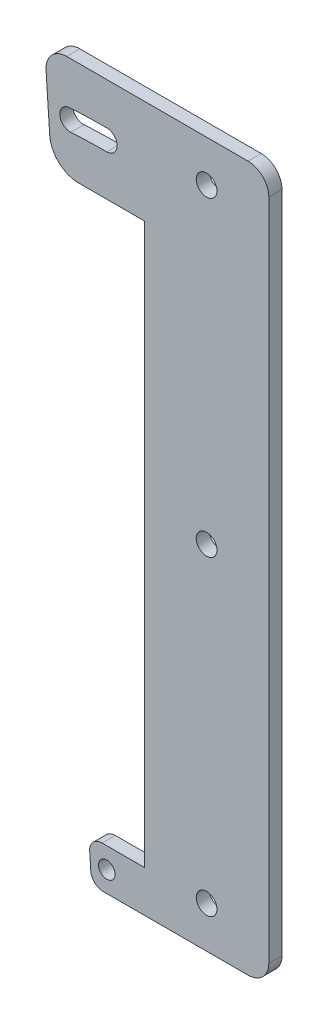
ISO-10303-21;
HEADER;
FILE_DESCRIPTION(('STEP AP214'),'2;1');
FILE_NAME('part.step','',(''),(''),'','','');
FILE_SCHEMA(('AUTOMOTIVE_DESIGN { 1 0 10303 214 1 1 1 1 }'));
ENDSEC;
DATA;
#1=APPLICATION_CONTEXT('core data for automotive mechanical design processes');
#2=APPLICATION_PROTOCOL_DEFINITION('international standard','automotive_design',2000,#1);
#3=PRODUCT_CONTEXT('',#1,'mechanical');
#4=PRODUCT('Part','Part','',(#3));
#5=PRODUCT_RELATED_PRODUCT_CATEGORY('part','',(#4));
#6=PRODUCT_DEFINITION_FORMATION('','',#4);
#7=PRODUCT_DEFINITION_CONTEXT('part definition',#1,'design');
#8=PRODUCT_DEFINITION('design','',#6,#7);
#9=PRODUCT_DEFINITION_SHAPE('','',#8);
#10=(LENGTH_UNIT() NAMED_UNIT(*) SI_UNIT(.MILLI.,.METRE.));
#11=(NAMED_UNIT(*) PLANE_ANGLE_UNIT() SI_UNIT($,.RADIAN.));
#12=(NAMED_UNIT(*) SI_UNIT($,.STERADIAN.) SOLID_ANGLE_UNIT());
#13=UNCERTAINTY_MEASURE_WITH_UNIT(LENGTH_MEASURE(1.E-05),#10,'distance_accuracy_value','');
#14=(GEOMETRIC_REPRESENTATION_CONTEXT(3) GLOBAL_UNCERTAINTY_ASSIGNED_CONTEXT((#13)) GLOBAL_UNIT_ASSIGNED_CONTEXT((#10,
#11,#12)) REPRESENTATION_CONTEXT('',''));
#15=CARTESIAN_POINT('',(0.,0.,0.));
#16=DIRECTION('',(0.,0.,1.));
#17=DIRECTION('',(1.,0.,0.));
#18=AXIS2_PLACEMENT_3D('',#15,#16,#17);
#19=CARTESIAN_POINT('',(0.,0.,-3.175));
#20=DIRECTION('',(-1.,0.,0.));
#21=DIRECTION('',(0.,0.,1.));
#22=AXIS2_PLACEMENT_3D('',#19,#20,#21);
#23=PLANE('',#22);
#24=DIRECTION('',(0.,-1.,0.));
#25=VECTOR('',#24,1.);
#26=CARTESIAN_POINT('',(0.,0.,-3.175));
#27=LINE('',#26,#25);
#28=CARTESIAN_POINT('',(0.,145.,-3.175));
#29=VERTEX_POINT('',#28);
#30=CARTESIAN_POINT('',(0.,10.,-3.175));
#31=VERTEX_POINT('',#30);
#32=EDGE_CURVE('E366',#29,#31,#27,.T.);
#33=ORIENTED_EDGE('',*,*,#32,.T.);
#34=DIRECTION('',(0.,0.,1.));
#35=VECTOR('',#34,1.);
#36=CARTESIAN_POINT('',(0.,10.,-3.17499999999999));
#37=LINE('',#36,#35);
#38=CARTESIAN_POINT('',(0.,10.,0.));
#39=VERTEX_POINT('',#38);
#40=EDGE_CURVE('E95',#31,#39,#37,.T.);
#41=ORIENTED_EDGE('',*,*,#40,.T.);
#42=DIRECTION('',(0.,-1.,0.));
#43=VECTOR('',#42,1.);
#44=CARTESIAN_POINT('',(0.,0.,0.));
#45=LINE('',#44,#43);
#46=CARTESIAN_POINT('',(0.,145.,0.));
#47=VERTEX_POINT('',#46);
#48=EDGE_CURVE('E90',#47,#39,#45,.T.);
#49=ORIENTED_EDGE('',*,*,#48,.F.);
#50=DIRECTION('',(0.,0.,1.));
#51=VECTOR('',#50,1.);
#52=CARTESIAN_POINT('',(0.,145.,-3.1749999999999));
#53=LINE('',#52,#51);
#54=EDGE_CURVE('E14',#29,#47,#53,.T.);
#55=ORIENTED_EDGE('',*,*,#54,.F.);
#56=EDGE_LOOP('',(#33,#41,#49,#55));
#57=FACE_BOUND('',#56,.T.);
#58=ADVANCED_FACE('F86',(#57),#23,.T.);
#59=CARTESIAN_POINT('',(0.,170.,-3.175));
#60=DIRECTION('',(0.,1.,0.));
#61=DIRECTION('',(0.,0.,1.));
#62=AXIS2_PLACEMENT_3D('',#59,#60,#61);
#63=PLANE('',#62);
#64=DIRECTION('',(-1.,0.,0.));
#65=VECTOR('',#64,1.);
#66=CARTESIAN_POINT('',(0.,170.,0.));
#67=LINE('',#66,#65);
#68=CARTESIAN_POINT('',(25.,170.,0.));
#69=VERTEX_POINT('',#68);
#70=CARTESIAN_POINT('',(-18.7202898598315,170.,1.02348685082632E-13));
#71=VERTEX_POINT('',#70);
#72=EDGE_CURVE('E372',#69,#71,#67,.T.);
#73=ORIENTED_EDGE('',*,*,#72,.F.);
#74=DIRECTION('',(0.,0.,1.));
#75=VECTOR('',#74,1.);
#76=CARTESIAN_POINT('',(25.,170.,-3.175));
#77=LINE('',#76,#75);
#78=CARTESIAN_POINT('',(25.,170.,-3.175));
#79=VERTEX_POINT('',#78);
#80=EDGE_CURVE('E111',#69,#79,#77,.F.);
#81=ORIENTED_EDGE('',*,*,#80,.T.);
#82=DIRECTION('',(-1.,0.,0.));
#83=VECTOR('',#82,1.);
#84=CARTESIAN_POINT('',(0.,170.,-3.175));
#85=LINE('',#84,#83);
#86=CARTESIAN_POINT('',(-18.7202898598315,170.,-3.1749999999999));
#87=VERTEX_POINT('',#86);
#88=EDGE_CURVE('E404',#79,#87,#85,.T.);
#89=ORIENTED_EDGE('',*,*,#88,.T.);
#90=DIRECTION('',(0.,0.,1.));
#91=VECTOR('',#90,1.);
#92=CARTESIAN_POINT('',(-18.7202898598315,170.,1.01481323344643E-13));
#93=LINE('',#92,#91);
#94=EDGE_CURVE('E223',#87,#71,#93,.T.);
#95=ORIENTED_EDGE('',*,*,#94,.T.);
#96=EDGE_LOOP('',(#73,#81,#89,#95));
#97=FACE_BOUND('',#96,.T.);
#98=ADVANCED_FACE('F451',(#97),#63,.T.);
#99=CARTESIAN_POINT('',(30.,0.,-3.175));
#100=DIRECTION('',(1.,0.,0.));
#101=DIRECTION('',(0.,0.,-1.));
#102=AXIS2_PLACEMENT_3D('',#99,#100,#101);
#103=PLANE('',#102);
#104=DIRECTION('',(0.,1.,0.));
#105=VECTOR('',#104,1.);
#106=CARTESIAN_POINT('',(30.,0.,0.));
#107=LINE('',#106,#105);
#108=CARTESIAN_POINT('',(30.,5.,0.));
#109=VERTEX_POINT('',#108);
#110=CARTESIAN_POINT('',(30.,165.,0.));
#111=VERTEX_POINT('',#110);
#112=EDGE_CURVE('E375',#109,#111,#107,.T.);
#113=ORIENTED_EDGE('',*,*,#112,.F.);
#114=DIRECTION('',(0.,0.,1.));
#115=VECTOR('',#114,1.);
#116=CARTESIAN_POINT('',(30.,5.,-3.175));
#117=LINE('',#116,#115);
#118=CARTESIAN_POINT('',(30.,5.,-3.175));
#119=VERTEX_POINT('',#118);
#120=EDGE_CURVE('E421',#109,#119,#117,.F.);
#121=ORIENTED_EDGE('',*,*,#120,.T.);
#122=DIRECTION('',(0.,1.,0.));
#123=VECTOR('',#122,1.);
#124=CARTESIAN_POINT('',(30.,0.,-3.175));
#125=LINE('',#124,#123);
#126=CARTESIAN_POINT('',(30.,165.,-3.175));
#127=VERTEX_POINT('',#126);
#128=EDGE_CURVE('E399',#119,#127,#125,.T.);
#129=ORIENTED_EDGE('',*,*,#128,.T.);
#130=DIRECTION('',(0.,0.,1.));
#131=VECTOR('',#130,1.);
#132=CARTESIAN_POINT('',(30.,165.,-3.175));
#133=LINE('',#132,#131);
#134=EDGE_CURVE('E418',#127,#111,#133,.T.);
#135=ORIENTED_EDGE('',*,*,#134,.T.);
#136=EDGE_LOOP('',(#113,#121,#129,#135));
#137=FACE_BOUND('',#136,.T.);
#138=ADVANCED_FACE('F444',(#137),#103,.T.);
#139=CARTESIAN_POINT('',(0.,0.,-3.175));
#140=DIRECTION('',(0.,-1.,0.));
#141=DIRECTION('',(0.,0.,-1.));
#142=AXIS2_PLACEMENT_3D('',#139,#140,#141);
#143=PLANE('',#142);
#144=DIRECTION('',(1.,0.,0.));
#145=VECTOR('',#144,1.);
#146=CARTESIAN_POINT('',(0.,0.,-3.175));
#147=LINE('',#146,#145);
#148=CARTESIAN_POINT('',(-9.93342579991076,0.,-3.17499999999996));
#149=VERTEX_POINT('',#148);
#150=CARTESIAN_POINT('',(25.,0.,-3.175));
#151=VERTEX_POINT('',#150);
#152=EDGE_CURVE('E371',#149,#151,#147,.T.);
#153=ORIENTED_EDGE('',*,*,#152,.T.);
#154=DIRECTION('',(0.,0.,1.));
#155=VECTOR('',#154,1.);
#156=CARTESIAN_POINT('',(25.,0.,-3.175));
#157=LINE('',#156,#155);
#158=CARTESIAN_POINT('',(25.,0.,0.));
#159=VERTEX_POINT('',#158);
#160=EDGE_CURVE('E407',#151,#159,#157,.T.);
#161=ORIENTED_EDGE('',*,*,#160,.T.);
#162=DIRECTION('',(1.,0.,0.));
#163=VECTOR('',#162,1.);
#164=CARTESIAN_POINT('',(0.,0.,0.));
#165=LINE('',#164,#163);
#166=CARTESIAN_POINT('',(-9.93342579991074,0.,0.));
#167=VERTEX_POINT('',#166);
#168=EDGE_CURVE('E373',#167,#159,#165,.T.);
#169=ORIENTED_EDGE('',*,*,#168,.F.);
#170=DIRECTION('',(0.,0.,1.));
#171=VECTOR('',#170,1.);
#172=CARTESIAN_POINT('',(-9.93342579991074,0.,0.));
#173=LINE('',#172,#171);
#174=EDGE_CURVE('E276',#167,#149,#173,.F.);
#175=ORIENTED_EDGE('',*,*,#174,.T.);
#176=EDGE_LOOP('',(#153,#161,#169,#175));
#177=FACE_BOUND('',#176,.T.);
#178=ADVANCED_FACE('F438',(#177),#143,.T.);
#179=CARTESIAN_POINT('',(0.,0.,-3.175));
#180=DIRECTION('',(0.,0.,-1.));
#181=DIRECTION('',(-1.,0.,0.));
#182=AXIS2_PLACEMENT_3D('',#179,#180,#181);
#183=PLANE('',#182);
#184=CARTESIAN_POINT('',(15.,10.,-3.175));
#185=DIRECTION('',(0.,0.,-1.));
#186=DIRECTION('',(-1.,0.,0.));
#187=AXIS2_PLACEMENT_3D('',#184,#185,#186);
#188=CIRCLE('',#187,2.5);
#189=CARTESIAN_POINT('',(12.5,10.,-3.175));
#190=VERTEX_POINT('',#189);
#191=EDGE_CURVE('E387',#190,#190,#188,.T.);
#192=ORIENTED_EDGE('',*,*,#191,.F.);
#193=EDGE_LOOP('',(#192));
#194=FACE_BOUND('',#193,.T.);
#195=CARTESIAN_POINT('',(15.,160.,-3.175));
#196=DIRECTION('',(0.,0.,-1.));
#197=DIRECTION('',(-1.,0.,0.));
#198=AXIS2_PLACEMENT_3D('',#195,#196,#197);
#199=CIRCLE('',#198,2.5);
#200=CARTESIAN_POINT('',(12.5,160.,-3.175));
#201=VERTEX_POINT('',#200);
#202=EDGE_CURVE('E793',#201,#201,#199,.T.);
#203=ORIENTED_EDGE('',*,*,#202,.F.);
#204=EDGE_LOOP('',(#203));
#205=FACE_BOUND('',#204,.T.);
#206=CARTESIAN_POINT('',(15.,85.,-3.175));
#207=DIRECTION('',(0.,0.,-1.));
#208=DIRECTION('',(-1.,0.,0.));
#209=AXIS2_PLACEMENT_3D('',#206,#207,#208);
#210=CIRCLE('',#209,2.5);
#211=CARTESIAN_POINT('',(12.5,85.,-3.175));
#212=VERTEX_POINT('',#211);
#213=EDGE_CURVE('E378',#212,#212,#210,.T.);
#214=ORIENTED_EDGE('',*,*,#213,.F.);
#215=EDGE_LOOP('',(#214));
#216=FACE_BOUND('',#215,.T.);
#217=ORIENTED_EDGE('',*,*,#128,.F.);
#218=CARTESIAN_POINT('',(25.,5.,-3.175));
#219=DIRECTION('',(0.,0.,-1.));
#220=DIRECTION('',(-1.,0.,0.));
#221=AXIS2_PLACEMENT_3D('',#218,#219,#220);
#222=CIRCLE('',#221,5.);
#223=EDGE_CURVE('E425',#119,#151,#222,.T.);
#224=ORIENTED_EDGE('',*,*,#223,.T.);
#225=ORIENTED_EDGE('',*,*,#152,.F.);
#226=CARTESIAN_POINT('',(-9.93342579991076,3.,-3.17499999999996));
#227=DIRECTION('',(0.,0.,-1.));
#228=DIRECTION('',(-1.,0.,0.));
#229=AXIS2_PLACEMENT_3D('',#226,#227,#228);
#230=CIRCLE('',#229,3.);
#231=CARTESIAN_POINT('',(-12.9267919431435,2.80060307788792,-3.17499999999994));
#232=VERTEX_POINT('',#231);
#233=EDGE_CURVE('E279',#149,#232,#230,.T.);
#234=ORIENTED_EDGE('',*,*,#233,.T.);
#235=DIRECTION('',(0.0664656407040243,-0.997788714410924,0.));
#236=VECTOR('',#235,1.);
#237=CARTESIAN_POINT('',(-12.6834647954809,-0.852247918143562,-3.17499999999994));
#238=LINE('',#237,#236);
#239=CARTESIAN_POINT('',(-13.193243706905,6.80060307788793,-3.17499999999993));
#240=VERTEX_POINT('',#239);
#241=EDGE_CURVE('E293',#240,#232,#238,.T.);
#242=ORIENTED_EDGE('',*,*,#241,.F.);
#243=CARTESIAN_POINT('',(-10.1998775636722,6.99999999999999,-3.17499999999995));
#244=DIRECTION('',(0.,0.,-1.));
#245=DIRECTION('',(-1.,0.,0.));
#246=AXIS2_PLACEMENT_3D('',#243,#244,#245);
#247=CIRCLE('',#246,3.);
#248=CARTESIAN_POINT('',(-10.1998775636723,9.99999999999999,-3.17499999999995));
#249=VERTEX_POINT('',#248);
#250=EDGE_CURVE('E283',#240,#249,#247,.T.);
#251=ORIENTED_EDGE('',*,*,#250,.T.);
#252=DIRECTION('',(-1.,0.,0.));
#253=VECTOR('',#252,1.);
#254=CARTESIAN_POINT('',(-2.0322177477909,10.,-3.175));
#255=LINE('',#254,#253);
#256=EDGE_CURVE('E311',#249,#31,#255,.F.);
#257=ORIENTED_EDGE('',*,*,#256,.T.);
#258=ORIENTED_EDGE('',*,*,#32,.F.);
#259=DIRECTION('',(-1.,0.,0.));
#260=VECTOR('',#259,1.);
#261=CARTESIAN_POINT('',(-2.0322177477909,145.,-3.175));
#262=LINE('',#261,#260);
#263=CARTESIAN_POINT('',(-15.8498892551873,145.,-3.17499999999992));
#264=VERTEX_POINT('',#263);
#265=EDGE_CURVE('E222',#29,#264,#262,.T.);
#266=ORIENTED_EDGE('',*,*,#265,.T.);
#267=CARTESIAN_POINT('',(-15.8498892551873,152.,-3.17499999999992));
#268=DIRECTION('',(0.,0.,-1.));
#269=DIRECTION('',(-1.,0.,0.));
#270=AXIS2_PLACEMENT_3D('',#267,#268,#269);
#271=CIRCLE('',#270,7.);
#272=CARTESIAN_POINT('',(-22.8344102560638,151.534740515072,-3.17499999999987));
#273=VERTEX_POINT('',#272);
#274=EDGE_CURVE('E238',#264,#273,#271,.T.);
#275=ORIENTED_EDGE('',*,*,#274,.T.);
#276=DIRECTION('',(0.0664656407040235,-0.997788714410924,0.));
#277=VECTOR('',#276,1.);
#278=CARTESIAN_POINT('',(-12.683464795481,-0.852247918143554,-3.17499999999994));
#279=LINE('',#278,#277);
#280=CARTESIAN_POINT('',(-23.7092334318862,164.66767179648,-3.17499999999986));
#281=VERTEX_POINT('',#280);
#282=EDGE_CURVE('E256',#281,#273,#279,.T.);
#283=ORIENTED_EDGE('',*,*,#282,.F.);
#284=CARTESIAN_POINT('',(-18.7202898598315,165.,-3.1749999999999));
#285=DIRECTION('',(0.,0.,-1.));
#286=DIRECTION('',(-1.,0.,0.));
#287=AXIS2_PLACEMENT_3D('',#284,#285,#286);
#288=CIRCLE('',#287,5.);
#289=EDGE_CURVE('E242',#281,#87,#288,.T.);
#290=ORIENTED_EDGE('',*,*,#289,.T.);
#291=ORIENTED_EDGE('',*,*,#88,.F.);
#292=CARTESIAN_POINT('',(25.,165.,-3.175));
#293=DIRECTION('',(0.,0.,-1.));
#294=DIRECTION('',(-1.,0.,0.));
#295=AXIS2_PLACEMENT_3D('',#292,#293,#294);
#296=CIRCLE('',#295,5.);
#297=EDGE_CURVE('E422',#79,#127,#296,.T.);
#298=ORIENTED_EDGE('',*,*,#297,.T.);
#299=EDGE_LOOP('',(#217,#224,#225,#234,#242,#251,#257,#258,#266,#275,#283,#290,#291,#298));
#300=FACE_BOUND('',#299,.T.);
#301=CARTESIAN_POINT('',(-9.0644354955818,4.99999999999999,-3.17499999999996));
#302=DIRECTION('',(0.,0.,-1.));
#303=DIRECTION('',(-1.,0.,0.));
#304=AXIS2_PLACEMENT_3D('',#301,#302,#303);
#305=CIRCLE('',#304,2.);
#306=CARTESIAN_POINT('',(-11.0644354955818,4.99999999999999,-3.17499999999995));
#307=VERTEX_POINT('',#306);
#308=EDGE_CURVE('E267',#307,#307,#305,.T.);
#309=ORIENTED_EDGE('',*,*,#308,.F.);
#310=EDGE_LOOP('',(#309));
#311=FACE_BOUND('',#310,.T.);
#312=CARTESIAN_POINT('',(-9.06443549558192,157.4,-3.17499999999996));
#313=DIRECTION('',(0.,0.,-1.));
#314=DIRECTION('',(-1.,0.,0.));
#315=AXIS2_PLACEMENT_3D('',#312,#313,#314);
#316=CIRCLE('',#315,2.5);
#317=CARTESIAN_POINT('',(-9.06443549558193,159.9,-3.17499999999942));
#318=VERTEX_POINT('',#317);
#319=CARTESIAN_POINT('',(-9.06443549558193,154.9,-3.17499999999944));
#320=VERTEX_POINT('',#319);
#321=EDGE_CURVE('E319',#318,#320,#316,.T.);
#322=ORIENTED_EDGE('',*,*,#321,.F.);
#323=CARTESIAN_POINT('',(-9.0644354955819,5.,-3.17499999999996));
#324=DIRECTION('',(0.,0.,-1.));
#325=DIRECTION('',(-1.,0.,0.));
#326=AXIS2_PLACEMENT_3D('',#323,#324,#325);
#327=CIRCLE('',#326,154.9);
#328=CARTESIAN_POINT('',(-18.0342025559494,159.640076561294,-3.1749999999999));
#329=VERTEX_POINT('',#328);
#330=EDGE_CURVE('E330',#329,#318,#327,.T.);
#331=ORIENTED_EDGE('',*,*,#330,.F.);
#332=CARTESIAN_POINT('',(-17.8894354955819,157.144271581286,-3.1749999999999));
#333=DIRECTION('',(0.,0.,-1.));
#334=DIRECTION('',(-1.,0.,0.));
#335=AXIS2_PLACEMENT_3D('',#332,#333,#334);
#336=CIRCLE('',#335,2.49999999999999);
#337=CARTESIAN_POINT('',(-17.7446684352145,154.648466601278,-3.1749999999999));
#338=VERTEX_POINT('',#337);
#339=EDGE_CURVE('E338',#338,#329,#336,.T.);
#340=ORIENTED_EDGE('',*,*,#339,.F.);
#341=CARTESIAN_POINT('',(-9.0644354955819,5.,-3.17499999999996));
#342=DIRECTION('',(0.,0.,-1.));
#343=DIRECTION('',(-1.,0.,0.));
#344=AXIS2_PLACEMENT_3D('',#341,#342,#343);
#345=CIRCLE('',#344,149.9);
#346=EDGE_CURVE('E347',#320,#338,#345,.F.);
#347=ORIENTED_EDGE('',*,*,#346,.F.);
#348=EDGE_LOOP('',(#322,#331,#340,#347));
#349=FACE_BOUND('',#348,.T.);
#350=ADVANCED_FACE('F361',(#194,#205,#216,#300,#311,#349),#183,.T.);
#351=CARTESIAN_POINT('',(0.,0.,0.));
#352=DIRECTION('',(0.,0.,-1.));
#353=DIRECTION('',(-1.,0.,0.));
#354=AXIS2_PLACEMENT_3D('',#351,#352,#353);
#355=PLANE('',#354);
#356=CARTESIAN_POINT('',(15.,10.,1.04083408558608E-13));
#357=DIRECTION('',(0.,0.,-1.));
#358=DIRECTION('',(-1.,0.,0.));
#359=AXIS2_PLACEMENT_3D('',#356,#357,#358);
#360=CIRCLE('',#359,2.5);
#361=CARTESIAN_POINT('',(12.5,10.,1.04083408558608E-13));
#362=VERTEX_POINT('',#361);
#363=EDGE_CURVE('E790',#362,#362,#360,.T.);
#364=ORIENTED_EDGE('',*,*,#363,.T.);
#365=EDGE_LOOP('',(#364));
#366=FACE_BOUND('',#365,.T.);
#367=CARTESIAN_POINT('',(15.,160.,1.04083408558608E-13));
#368=DIRECTION('',(0.,0.,-1.));
#369=DIRECTION('',(-1.,0.,0.));
#370=AXIS2_PLACEMENT_3D('',#367,#368,#369);
#371=CIRCLE('',#370,2.5);
#372=CARTESIAN_POINT('',(12.5,160.,1.04083408558608E-13));
#373=VERTEX_POINT('',#372);
#374=EDGE_CURVE('E384',#373,#373,#371,.T.);
#375=ORIENTED_EDGE('',*,*,#374,.T.);
#376=EDGE_LOOP('',(#375));
#377=FACE_BOUND('',#376,.T.);
#378=CARTESIAN_POINT('',(15.,85.,1.04083408558608E-13));
#379=DIRECTION('',(0.,0.,-1.));
#380=DIRECTION('',(-1.,0.,0.));
#381=AXIS2_PLACEMENT_3D('',#378,#379,#380);
#382=CIRCLE('',#381,2.5);
#383=CARTESIAN_POINT('',(12.5,85.,1.04083408558608E-13));
#384=VERTEX_POINT('',#383);
#385=EDGE_CURVE('E374',#384,#384,#382,.T.);
#386=ORIENTED_EDGE('',*,*,#385,.T.);
#387=EDGE_LOOP('',(#386));
#388=FACE_BOUND('',#387,.T.);
#389=ORIENTED_EDGE('',*,*,#168,.T.);
#390=CARTESIAN_POINT('',(25.,5.,0.));
#391=DIRECTION('',(0.,0.,-1.));
#392=DIRECTION('',(-1.,0.,0.));
#393=AXIS2_PLACEMENT_3D('',#390,#391,#392);
#394=CIRCLE('',#393,5.);
#395=EDGE_CURVE('E416',#159,#109,#394,.F.);
#396=ORIENTED_EDGE('',*,*,#395,.T.);
#397=ORIENTED_EDGE('',*,*,#112,.T.);
#398=CARTESIAN_POINT('',(25.,165.,0.));
#399=DIRECTION('',(0.,0.,-1.));
#400=DIRECTION('',(-1.,0.,0.));
#401=AXIS2_PLACEMENT_3D('',#398,#399,#400);
#402=CIRCLE('',#401,5.);
#403=EDGE_CURVE('E414',#111,#69,#402,.F.);
#404=ORIENTED_EDGE('',*,*,#403,.T.);
#405=ORIENTED_EDGE('',*,*,#72,.T.);
#406=CARTESIAN_POINT('',(-18.7202898598315,165.,1.02348685082632E-13));
#407=DIRECTION('',(0.,0.,-1.));
#408=DIRECTION('',(-1.,0.,0.));
#409=AXIS2_PLACEMENT_3D('',#406,#407,#408);
#410=CIRCLE('',#409,5.);
#411=CARTESIAN_POINT('',(-23.7092334318861,164.66767179648,1.37043154602168E-13));
#412=VERTEX_POINT('',#411);
#413=EDGE_CURVE('E234',#71,#412,#410,.F.);
#414=ORIENTED_EDGE('',*,*,#413,.T.);
#415=DIRECTION('',(-0.0664656407040234,0.997788714410924,0.));
#416=VECTOR('',#415,1.);
#417=CARTESIAN_POINT('',(-24.0644354955819,170.,1.38777878078145E-13));
#418=LINE('',#417,#416);
#419=CARTESIAN_POINT('',(-22.8344102560638,151.534740515072,1.30104260698261E-13));
#420=VERTEX_POINT('',#419);
#421=EDGE_CURVE('E230',#420,#412,#418,.T.);
#422=ORIENTED_EDGE('',*,*,#421,.F.);
#423=CARTESIAN_POINT('',(-15.8498892551873,152.,0.));
#424=DIRECTION('',(0.,0.,-1.));
#425=DIRECTION('',(-1.,0.,0.));
#426=AXIS2_PLACEMENT_3D('',#423,#424,#425);
#427=CIRCLE('',#426,7.);
#428=CARTESIAN_POINT('',(-15.8498892551873,145.,0.));
#429=VERTEX_POINT('',#428);
#430=EDGE_CURVE('E226',#420,#429,#427,.F.);
#431=ORIENTED_EDGE('',*,*,#430,.T.);
#432=DIRECTION('',(-1.,0.,0.));
#433=VECTOR('',#432,1.);
#434=CARTESIAN_POINT('',(-2.0322177477909,145.,0.));
#435=LINE('',#434,#433);
#436=EDGE_CURVE('E213',#47,#429,#435,.T.);
#437=ORIENTED_EDGE('',*,*,#436,.F.);
#438=ORIENTED_EDGE('',*,*,#48,.T.);
#439=DIRECTION('',(-1.,0.,0.));
#440=VECTOR('',#439,1.);
#441=CARTESIAN_POINT('',(-2.0322177477909,10.,0.));
#442=LINE('',#441,#440);
#443=CARTESIAN_POINT('',(-10.1998775636722,9.99999999999999,0.));
#444=VERTEX_POINT('',#443);
#445=EDGE_CURVE('E103',#444,#39,#442,.F.);
#446=ORIENTED_EDGE('',*,*,#445,.F.);
#447=CARTESIAN_POINT('',(-10.1998775636722,6.99999999999999,0.));
#448=DIRECTION('',(0.,0.,-1.));
#449=DIRECTION('',(-1.,0.,0.));
#450=AXIS2_PLACEMENT_3D('',#447,#448,#449);
#451=CIRCLE('',#450,3.);
#452=CARTESIAN_POINT('',(-13.193243706905,6.80060307788795,0.));
#453=VERTEX_POINT('',#452);
#454=EDGE_CURVE('E274',#444,#453,#451,.F.);
#455=ORIENTED_EDGE('',*,*,#454,.T.);
#456=DIRECTION('',(-0.0664656407040243,0.997788714410923,0.));
#457=VECTOR('',#456,1.);
#458=CARTESIAN_POINT('',(-24.0644354955819,170.,2.85362011798185E-13));
#459=LINE('',#458,#457);
#460=CARTESIAN_POINT('',(-12.9267919431435,2.80060307788795,0.));
#461=VERTEX_POINT('',#460);
#462=EDGE_CURVE('E301',#461,#453,#459,.T.);
#463=ORIENTED_EDGE('',*,*,#462,.F.);
#464=CARTESIAN_POINT('',(-9.93342579991074,2.99999999999999,0.));
#465=DIRECTION('',(0.,0.,-1.));
#466=DIRECTION('',(-1.,0.,0.));
#467=AXIS2_PLACEMENT_3D('',#464,#465,#466);
#468=CIRCLE('',#467,3.);
#469=EDGE_CURVE('E271',#461,#167,#468,.F.);
#470=ORIENTED_EDGE('',*,*,#469,.T.);
#471=EDGE_LOOP('',(#389,#396,#397,#404,#405,#414,#422,#431,#437,#438,#446,#455,#463,#470));
#472=FACE_BOUND('',#471,.T.);
#473=CARTESIAN_POINT('',(-9.06443549558178,4.99999999999999,0.));
#474=DIRECTION('',(0.,0.,1.));
#475=DIRECTION('',(1.,0.,0.));
#476=AXIS2_PLACEMENT_3D('',#473,#474,#475);
#477=CIRCLE('',#476,2.);
#478=CARTESIAN_POINT('',(-7.06443549558178,4.99999999999999,0.));
#479=VERTEX_POINT('',#478);
#480=EDGE_CURVE('E304',#479,#479,#477,.T.);
#481=ORIENTED_EDGE('',*,*,#480,.F.);
#482=EDGE_LOOP('',(#481));
#483=FACE_BOUND('',#482,.T.);
#484=CARTESIAN_POINT('',(-9.06443549558188,5.,0.));
#485=DIRECTION('',(0.,0.,1.));
#486=DIRECTION('',(1.,0.,0.));
#487=AXIS2_PLACEMENT_3D('',#484,#485,#486);
#488=CIRCLE('',#487,154.9);
#489=CARTESIAN_POINT('',(-9.06443549558191,159.9,0.));
#490=VERTEX_POINT('',#489);
#491=CARTESIAN_POINT('',(-18.0342025559494,159.640076561294,0.));
#492=VERTEX_POINT('',#491);
#493=EDGE_CURVE('E325',#490,#492,#488,.T.);
#494=ORIENTED_EDGE('',*,*,#493,.F.);
#495=CARTESIAN_POINT('',(-9.06443549558189,157.4,0.));
#496=DIRECTION('',(0.,0.,1.));
#497=DIRECTION('',(1.,0.,0.));
#498=AXIS2_PLACEMENT_3D('',#495,#496,#497);
#499=CIRCLE('',#498,2.5);
#500=CARTESIAN_POINT('',(-9.06443549558191,154.9,0.));
#501=VERTEX_POINT('',#500);
#502=EDGE_CURVE('E457',#501,#490,#499,.T.);
#503=ORIENTED_EDGE('',*,*,#502,.F.);
#504=CARTESIAN_POINT('',(-9.06443549558188,5.,0.));
#505=DIRECTION('',(0.,0.,-1.));
#506=DIRECTION('',(1.,0.,0.));
#507=AXIS2_PLACEMENT_3D('',#504,#505,#506);
#508=CIRCLE('',#507,149.9);
#509=CARTESIAN_POINT('',(-17.7446684352144,154.648466601278,0.));
#510=VERTEX_POINT('',#509);
#511=EDGE_CURVE('E343',#510,#501,#508,.T.);
#512=ORIENTED_EDGE('',*,*,#511,.F.);
#513=CARTESIAN_POINT('',(-17.8894354955819,157.144271581286,0.));
#514=DIRECTION('',(0.,0.,1.));
#515=DIRECTION('',(1.,0.,0.));
#516=AXIS2_PLACEMENT_3D('',#513,#514,#515);
#517=CIRCLE('',#516,2.49999999999999);
#518=EDGE_CURVE('E334',#492,#510,#517,.T.);
#519=ORIENTED_EDGE('',*,*,#518,.F.);
#520=EDGE_LOOP('',(#494,#503,#512,#519));
#521=FACE_BOUND('',#520,.T.);
#522=ADVANCED_FACE('F88',(#366,#377,#388,#472,#483,#521),#355,.F.);
#523=CARTESIAN_POINT('',(25.,5.,-3.175));
#524=DIRECTION('',(0.,0.,1.));
#525=DIRECTION('',(1.,0.,0.));
#526=AXIS2_PLACEMENT_3D('',#523,#524,#525);
#527=CYLINDRICAL_SURFACE('',#526,5.);
#528=ORIENTED_EDGE('',*,*,#223,.F.);
#529=ORIENTED_EDGE('',*,*,#120,.F.);
#530=ORIENTED_EDGE('',*,*,#395,.F.);
#531=ORIENTED_EDGE('',*,*,#160,.F.);
#532=EDGE_LOOP('',(#528,#529,#530,#531));
#533=FACE_BOUND('',#532,.T.);
#534=ADVANCED_FACE('F441',(#533),#527,.T.);
#535=CARTESIAN_POINT('',(25.,165.,-3.175));
#536=DIRECTION('',(0.,0.,1.));
#537=DIRECTION('',(1.,0.,0.));
#538=AXIS2_PLACEMENT_3D('',#535,#536,#537);
#539=CYLINDRICAL_SURFACE('',#538,5.);
#540=ORIENTED_EDGE('',*,*,#297,.F.);
#541=ORIENTED_EDGE('',*,*,#80,.F.);
#542=ORIENTED_EDGE('',*,*,#403,.F.);
#543=ORIENTED_EDGE('',*,*,#134,.F.);
#544=EDGE_LOOP('',(#540,#541,#542,#543));
#545=FACE_BOUND('',#544,.T.);
#546=ADVANCED_FACE('F448',(#545),#539,.T.);
#547=CARTESIAN_POINT('',(15.,85.,1.04083408558608E-13));
#548=DIRECTION('',(0.,0.,-1.));
#549=DIRECTION('',(-1.,0.,0.));
#550=AXIS2_PLACEMENT_3D('',#547,#548,#549);
#551=CYLINDRICAL_SURFACE('',#550,2.5);
#552=ORIENTED_EDGE('',*,*,#385,.F.);
#553=EDGE_LOOP('',(#552));
#554=FACE_BOUND('',#553,.T.);
#555=ORIENTED_EDGE('',*,*,#213,.T.);
#556=EDGE_LOOP('',(#555));
#557=FACE_BOUND('',#556,.T.);
#558=ADVANCED_FACE('F495',(#554,#557),#551,.F.);
#559=CARTESIAN_POINT('',(15.,160.,1.04083408558608E-13));
#560=DIRECTION('',(0.,0.,-1.));
#561=DIRECTION('',(-1.,0.,0.));
#562=AXIS2_PLACEMENT_3D('',#559,#560,#561);
#563=CYLINDRICAL_SURFACE('',#562,2.5);
#564=ORIENTED_EDGE('',*,*,#374,.F.);
#565=EDGE_LOOP('',(#564));
#566=FACE_BOUND('',#565,.T.);
#567=ORIENTED_EDGE('',*,*,#202,.T.);
#568=EDGE_LOOP('',(#567));
#569=FACE_BOUND('',#568,.T.);
#570=ADVANCED_FACE('F499',(#566,#569),#563,.F.);
#571=CARTESIAN_POINT('',(15.,10.,1.04083408558608E-13));
#572=DIRECTION('',(0.,0.,-1.));
#573=DIRECTION('',(-1.,0.,0.));
#574=AXIS2_PLACEMENT_3D('',#571,#572,#573);
#575=CYLINDRICAL_SURFACE('',#574,2.5);
#576=ORIENTED_EDGE('',*,*,#363,.F.);
#577=EDGE_LOOP('',(#576));
#578=FACE_BOUND('',#577,.T.);
#579=ORIENTED_EDGE('',*,*,#191,.T.);
#580=EDGE_LOOP('',(#579));
#581=FACE_BOUND('',#580,.T.);
#582=ADVANCED_FACE('F505',(#578,#581),#575,.F.);
#583=CARTESIAN_POINT('',(-2.0322177477909,10.,-1.5875));
#584=DIRECTION('',(0.,-1.,0.));
#585=DIRECTION('',(-1.,0.,0.));
#586=AXIS2_PLACEMENT_3D('',#583,#584,#585);
#587=PLANE('',#586);
#588=ORIENTED_EDGE('',*,*,#445,.T.);
#589=ORIENTED_EDGE('',*,*,#40,.F.);
#590=ORIENTED_EDGE('',*,*,#256,.F.);
#591=DIRECTION('',(0.,0.,1.));
#592=VECTOR('',#591,1.);
#593=CARTESIAN_POINT('',(-10.1998775636722,9.99999999999999,0.));
#594=LINE('',#593,#592);
#595=EDGE_CURVE('E269',#249,#444,#594,.T.);
#596=ORIENTED_EDGE('',*,*,#595,.T.);
#597=EDGE_LOOP('',(#588,#589,#590,#596));
#598=FACE_BOUND('',#597,.T.);
#599=ADVANCED_FACE('F534',(#598),#587,.F.);
#600=CARTESIAN_POINT('',(-9.06443549558202,5.00000000000002,-34.1750000000001));
#601=DIRECTION('',(0.,0.,1.));
#602=DIRECTION('',(1.,0.,0.));
#603=AXIS2_PLACEMENT_3D('',#600,#601,#602);
#604=CYLINDRICAL_SURFACE('',#603,2.);
#605=ORIENTED_EDGE('',*,*,#308,.T.);
#606=EDGE_LOOP('',(#605));
#607=FACE_BOUND('',#606,.T.);
#608=ORIENTED_EDGE('',*,*,#480,.T.);
#609=EDGE_LOOP('',(#608));
#610=FACE_BOUND('',#609,.T.);
#611=ADVANCED_FACE('F538',(#607,#610),#604,.F.);
#612=CARTESIAN_POINT('',(-9.93342579991098,3.00000000000002,-34.1750000000001));
#613=DIRECTION('',(0.,0.,1.));
#614=DIRECTION('',(1.,0.,0.));
#615=AXIS2_PLACEMENT_3D('',#612,#613,#614);
#616=CYLINDRICAL_SURFACE('',#615,3.);
#617=ORIENTED_EDGE('',*,*,#233,.F.);
#618=ORIENTED_EDGE('',*,*,#174,.F.);
#619=ORIENTED_EDGE('',*,*,#469,.F.);
#620=DIRECTION('',(0.,0.,1.));
#621=VECTOR('',#620,1.);
#622=CARTESIAN_POINT('',(-12.9267919431437,2.80060307788795,-34.1750000000001));
#623=LINE('',#622,#621);
#624=EDGE_CURVE('E298',#232,#461,#623,.T.);
#625=ORIENTED_EDGE('',*,*,#624,.F.);
#626=EDGE_LOOP('',(#617,#618,#619,#625));
#627=FACE_BOUND('',#626,.T.);
#628=ADVANCED_FACE('F702',(#627),#616,.T.);
#629=CARTESIAN_POINT('',(-10.1998775636722,6.99999999999999,0.));
#630=DIRECTION('',(0.,0.,1.));
#631=DIRECTION('',(1.,0.,0.));
#632=AXIS2_PLACEMENT_3D('',#629,#630,#631);
#633=CYLINDRICAL_SURFACE('',#632,3.);
#634=ORIENTED_EDGE('',*,*,#250,.F.);
#635=DIRECTION('',(0.,0.,1.));
#636=VECTOR('',#635,1.);
#637=CARTESIAN_POINT('',(-13.1932437069052,6.80060307788793,-34.1750000000001));
#638=LINE('',#637,#636);
#639=EDGE_CURVE('E299',#453,#240,#638,.F.);
#640=ORIENTED_EDGE('',*,*,#639,.F.);
#641=ORIENTED_EDGE('',*,*,#454,.F.);
#642=ORIENTED_EDGE('',*,*,#595,.F.);
#643=EDGE_LOOP('',(#634,#640,#641,#642));
#644=FACE_BOUND('',#643,.T.);
#645=ADVANCED_FACE('F694',(#644),#633,.T.);
#646=CARTESIAN_POINT('',(-24.0644354955822,170.,-34.1749999999998));
#647=DIRECTION('',(0.997788714410923,0.0664656407040243,0.));
#648=DIRECTION('',(0.0664656407040243,-0.997788714410924,0.));
#649=AXIS2_PLACEMENT_3D('',#646,#647,#648);
#650=PLANE('',#649);
#651=ORIENTED_EDGE('',*,*,#462,.T.);
#652=ORIENTED_EDGE('',*,*,#639,.T.);
#653=ORIENTED_EDGE('',*,*,#241,.T.);
#654=ORIENTED_EDGE('',*,*,#624,.T.);
#655=EDGE_LOOP('',(#651,#652,#653,#654));
#656=FACE_BOUND('',#655,.T.);
#657=ADVANCED_FACE('F546',(#656),#650,.F.);
#658=CARTESIAN_POINT('',(-2.0322177477909,145.,-1.5875));
#659=DIRECTION('',(0.,-1.,0.));
#660=DIRECTION('',(-1.,0.,0.));
#661=AXIS2_PLACEMENT_3D('',#658,#659,#660);
#662=PLANE('',#661);
#663=ORIENTED_EDGE('',*,*,#54,.T.);
#664=ORIENTED_EDGE('',*,*,#436,.T.);
#665=DIRECTION('',(0.,0.,1.));
#666=VECTOR('',#665,1.);
#667=CARTESIAN_POINT('',(-15.8498892551873,145.,-3.17499999999992));
#668=LINE('',#667,#666);
#669=EDGE_CURVE('E217',#429,#264,#668,.F.);
#670=ORIENTED_EDGE('',*,*,#669,.T.);
#671=ORIENTED_EDGE('',*,*,#265,.F.);
#672=EDGE_LOOP('',(#663,#664,#670,#671));
#673=FACE_BOUND('',#672,.T.);
#674=ADVANCED_FACE('F215',(#673),#662,.T.);
#675=CARTESIAN_POINT('',(-15.8498892551875,152.,-34.175));
#676=DIRECTION('',(0.,0.,-1.));
#677=DIRECTION('',(-1.,0.,0.));
#678=AXIS2_PLACEMENT_3D('',#675,#676,#677);
#679=CYLINDRICAL_SURFACE('',#678,7.);
#680=ORIENTED_EDGE('',*,*,#274,.F.);
#681=ORIENTED_EDGE('',*,*,#669,.F.);
#682=ORIENTED_EDGE('',*,*,#430,.F.);
#683=DIRECTION('',(0.,0.,1.));
#684=VECTOR('',#683,1.);
#685=CARTESIAN_POINT('',(-22.8344102560638,151.534740515072,1.29236898960272E-13));
#686=LINE('',#685,#684);
#687=EDGE_CURVE('E261',#273,#420,#686,.T.);
#688=ORIENTED_EDGE('',*,*,#687,.F.);
#689=EDGE_LOOP('',(#680,#681,#682,#688));
#690=FACE_BOUND('',#689,.T.);
#691=ADVANCED_FACE('F236',(#690),#679,.T.);
#692=CARTESIAN_POINT('',(-18.7202898598315,165.,1.02348685082632E-13));
#693=DIRECTION('',(0.,0.,-1.));
#694=DIRECTION('',(-1.,0.,0.));
#695=AXIS2_PLACEMENT_3D('',#692,#693,#694);
#696=CYLINDRICAL_SURFACE('',#695,5.);
#697=ORIENTED_EDGE('',*,*,#289,.F.);
#698=DIRECTION('',(0.,0.,1.));
#699=VECTOR('',#698,1.);
#700=CARTESIAN_POINT('',(-23.7092334318862,164.66767179648,-3.17499999999986));
#701=LINE('',#700,#699);
#702=EDGE_CURVE('E262',#412,#281,#701,.F.);
#703=ORIENTED_EDGE('',*,*,#702,.F.);
#704=ORIENTED_EDGE('',*,*,#413,.F.);
#705=ORIENTED_EDGE('',*,*,#94,.F.);
#706=EDGE_LOOP('',(#697,#703,#704,#705));
#707=FACE_BOUND('',#706,.T.);
#708=ADVANCED_FACE('F455',(#707),#696,.T.);
#709=CARTESIAN_POINT('',(-24.0644354955821,170.,-34.175));
#710=DIRECTION('',(0.997788714410924,0.0664656407040234,0.));
#711=DIRECTION('',(0.0664656407040235,-0.997788714410924,0.));
#712=AXIS2_PLACEMENT_3D('',#709,#710,#711);
#713=PLANE('',#712);
#714=ORIENTED_EDGE('',*,*,#421,.T.);
#715=ORIENTED_EDGE('',*,*,#702,.T.);
#716=ORIENTED_EDGE('',*,*,#282,.T.);
#717=ORIENTED_EDGE('',*,*,#687,.T.);
#718=EDGE_LOOP('',(#714,#715,#716,#717));
#719=FACE_BOUND('',#718,.T.);
#720=ADVANCED_FACE('F354',(#719),#713,.F.);
#721=CARTESIAN_POINT('',(-9.06443549558212,5.,-34.1750000000001));
#722=DIRECTION('',(0.,0.,1.));
#723=DIRECTION('',(1.,0.,0.));
#724=AXIS2_PLACEMENT_3D('',#721,#722,#723);
#725=CYLINDRICAL_SURFACE('',#724,149.9);
#726=ORIENTED_EDGE('',*,*,#346,.T.);
#727=DIRECTION('',(0.,0.,1.));
#728=VECTOR('',#727,1.);
#729=CARTESIAN_POINT('',(-17.7446684352147,154.648466601278,-34.175));
#730=LINE('',#729,#728);
#731=EDGE_CURVE('E346',#338,#510,#730,.T.);
#732=ORIENTED_EDGE('',*,*,#731,.T.);
#733=ORIENTED_EDGE('',*,*,#511,.T.);
#734=DIRECTION('',(0.,0.,1.));
#735=VECTOR('',#734,1.);
#736=CARTESIAN_POINT('',(-9.06443549558214,154.9,-34.1750000000001));
#737=LINE('',#736,#735);
#738=EDGE_CURVE('E324',#320,#501,#737,.T.);
#739=ORIENTED_EDGE('',*,*,#738,.F.);
#740=EDGE_LOOP('',(#726,#732,#733,#739));
#741=FACE_BOUND('',#740,.T.);
#742=ADVANCED_FACE('F464',(#741),#725,.T.);
#743=CARTESIAN_POINT('',(-17.8894354955821,157.144271581286,-34.175));
#744=DIRECTION('',(0.,0.,1.));
#745=DIRECTION('',(1.,0.,0.));
#746=AXIS2_PLACEMENT_3D('',#743,#744,#745);
#747=CYLINDRICAL_SURFACE('',#746,2.49999999999999);
#748=ORIENTED_EDGE('',*,*,#339,.T.);
#749=DIRECTION('',(0.,0.,1.));
#750=VECTOR('',#749,1.);
#751=CARTESIAN_POINT('',(-18.0342025559496,159.640076561294,-34.175));
#752=LINE('',#751,#750);
#753=EDGE_CURVE('E337',#329,#492,#752,.T.);
#754=ORIENTED_EDGE('',*,*,#753,.T.);
#755=ORIENTED_EDGE('',*,*,#518,.T.);
#756=ORIENTED_EDGE('',*,*,#731,.F.);
#757=EDGE_LOOP('',(#748,#754,#755,#756));
#758=FACE_BOUND('',#757,.T.);
#759=ADVANCED_FACE('F474',(#758),#747,.F.);
#760=CARTESIAN_POINT('',(-9.06443549558212,5.,-34.1750000000001));
#761=DIRECTION('',(0.,0.,1.));
#762=DIRECTION('',(1.,0.,0.));
#763=AXIS2_PLACEMENT_3D('',#760,#761,#762);
#764=CYLINDRICAL_SURFACE('',#763,154.9);
#765=ORIENTED_EDGE('',*,*,#330,.T.);
#766=DIRECTION('',(0.,0.,1.));
#767=VECTOR('',#766,1.);
#768=CARTESIAN_POINT('',(-9.06443549558214,159.9,-34.1750000000001));
#769=LINE('',#768,#767);
#770=EDGE_CURVE('E328',#318,#490,#769,.T.);
#771=ORIENTED_EDGE('',*,*,#770,.T.);
#772=ORIENTED_EDGE('',*,*,#493,.T.);
#773=ORIENTED_EDGE('',*,*,#753,.F.);
#774=EDGE_LOOP('',(#765,#771,#772,#773));
#775=FACE_BOUND('',#774,.T.);
#776=ADVANCED_FACE('F469',(#775),#764,.F.);
#777=CARTESIAN_POINT('',(-9.06443549558213,157.4,-34.1750000000001));
#778=DIRECTION('',(0.,0.,1.));
#779=DIRECTION('',(1.,0.,0.));
#780=AXIS2_PLACEMENT_3D('',#777,#778,#779);
#781=CYLINDRICAL_SURFACE('',#780,2.5);
#782=ORIENTED_EDGE('',*,*,#321,.T.);
#783=ORIENTED_EDGE('',*,*,#738,.T.);
#784=ORIENTED_EDGE('',*,*,#502,.T.);
#785=ORIENTED_EDGE('',*,*,#770,.F.);
#786=EDGE_LOOP('',(#782,#783,#784,#785));
#787=FACE_BOUND('',#786,.T.);
#788=ADVANCED_FACE('F461',(#787),#781,.F.);
#789=CLOSED_SHELL('',(#58,#98,#138,#178,#350,#522,#534,#546,#558,#570,#582,#599,#611,#628,#645,
#657,#674,#691,#708,#720,#742,#759,#776,#788));
#790=MANIFOLD_SOLID_BREP('B2',#789);
#791=ADVANCED_BREP_SHAPE_REPRESENTATION('',(#18,#790),#14);
#792=SHAPE_DEFINITION_REPRESENTATION(#9,#791);
ENDSEC;
END-ISO-10303-21;
